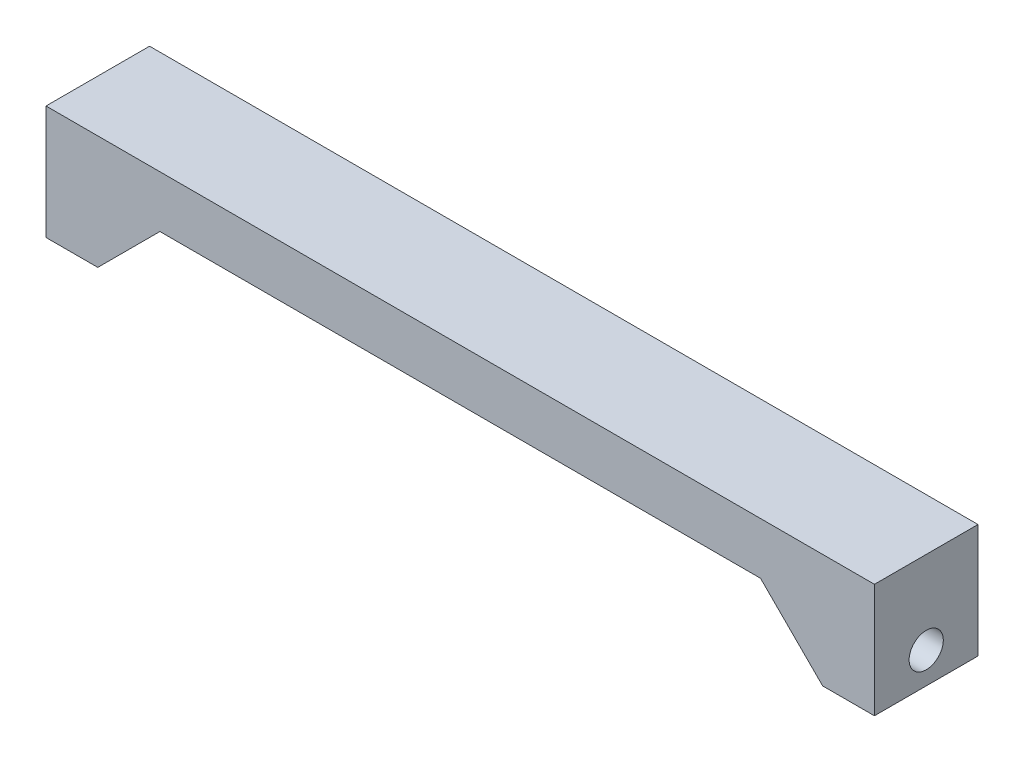
ISO-10303-21;
HEADER;
FILE_DESCRIPTION(('STEP AP214'),'2;1');
FILE_NAME('part.step','',(''),(''),'','','');
FILE_SCHEMA(('AUTOMOTIVE_DESIGN { 1 0 10303 214 1 1 1 1 }'));
ENDSEC;
DATA;
#1=APPLICATION_CONTEXT('core data for automotive mechanical design processes');
#2=APPLICATION_PROTOCOL_DEFINITION('international standard','automotive_design',2000,#1);
#3=PRODUCT_CONTEXT('',#1,'mechanical');
#4=PRODUCT('Part','Part','',(#3));
#5=PRODUCT_RELATED_PRODUCT_CATEGORY('part','',(#4));
#6=PRODUCT_DEFINITION_FORMATION('','',#4);
#7=PRODUCT_DEFINITION_CONTEXT('part definition',#1,'design');
#8=PRODUCT_DEFINITION('design','',#6,#7);
#9=PRODUCT_DEFINITION_SHAPE('','',#8);
#10=(LENGTH_UNIT() NAMED_UNIT(*) SI_UNIT(.MILLI.,.METRE.));
#11=(NAMED_UNIT(*) PLANE_ANGLE_UNIT() SI_UNIT($,.RADIAN.));
#12=(NAMED_UNIT(*) SI_UNIT($,.STERADIAN.) SOLID_ANGLE_UNIT());
#13=UNCERTAINTY_MEASURE_WITH_UNIT(LENGTH_MEASURE(1.E-05),#10,'distance_accuracy_value','');
#14=(GEOMETRIC_REPRESENTATION_CONTEXT(3) GLOBAL_UNCERTAINTY_ASSIGNED_CONTEXT((#13)) GLOBAL_UNIT_ASSIGNED_CONTEXT((#10,
#11,#12)) REPRESENTATION_CONTEXT('',''));
#15=CARTESIAN_POINT('',(0.,0.,0.));
#16=DIRECTION('',(0.,0.,1.));
#17=DIRECTION('',(1.,0.,0.));
#18=AXIS2_PLACEMENT_3D('',#15,#16,#17);
#19=CARTESIAN_POINT('',(35.,-5.00000000000001,10.));
#20=DIRECTION('',(0.,1.,0.));
#21=DIRECTION('',(0.,0.,1.));
#22=AXIS2_PLACEMENT_3D('',#19,#20,#21);
#23=PLANE('',#22);
#24=DIRECTION('',(-1.,0.,0.));
#25=VECTOR('',#24,1.);
#26=CARTESIAN_POINT('',(29.,-5.00000000000001,7.99999999999999));
#27=LINE('',#26,#25);
#28=CARTESIAN_POINT('',(35.,-5.00000000000001,7.99999999999999));
#29=VERTEX_POINT('',#28);
#30=CARTESIAN_POINT('',(29.,-5.00000000000001,7.99999999999999));
#31=VERTEX_POINT('',#30);
#32=EDGE_CURVE('E154',#29,#31,#27,.T.);
#33=ORIENTED_EDGE('',*,*,#32,.T.);
#34=DIRECTION('',(0.,0.,1.));
#35=VECTOR('',#34,1.);
#36=CARTESIAN_POINT('',(29.,-5.00000000000001,7.99999999999999));
#37=LINE('',#36,#35);
#38=CARTESIAN_POINT('',(29.,-5.00000000000001,9.99999999999999));
#39=VERTEX_POINT('',#38);
#40=EDGE_CURVE('E139',#31,#39,#37,.T.);
#41=ORIENTED_EDGE('',*,*,#40,.T.);
#42=DIRECTION('',(1.,0.,0.));
#43=VECTOR('',#42,1.);
#44=CARTESIAN_POINT('',(35.,-5.00000000000001,10.));
#45=LINE('',#44,#43);
#46=CARTESIAN_POINT('',(-29.,-5.00000000000001,9.99999999999999));
#47=VERTEX_POINT('',#46);
#48=EDGE_CURVE('E224',#47,#39,#45,.T.);
#49=ORIENTED_EDGE('',*,*,#48,.F.);
#50=DIRECTION('',(0.,0.,1.));
#51=VECTOR('',#50,1.);
#52=CARTESIAN_POINT('',(-29.,-5.00000000000001,7.99999999999999));
#53=LINE('',#52,#51);
#54=CARTESIAN_POINT('',(-29.,-5.00000000000001,7.99999999999999));
#55=VERTEX_POINT('',#54);
#56=EDGE_CURVE('E184',#55,#47,#53,.T.);
#57=ORIENTED_EDGE('',*,*,#56,.F.);
#58=DIRECTION('',(1.,0.,0.));
#59=VECTOR('',#58,1.);
#60=CARTESIAN_POINT('',(-29.,-5.00000000000001,7.99999999999999));
#61=LINE('',#60,#59);
#62=CARTESIAN_POINT('',(-35.,-5.00000000000001,7.99999999999999));
#63=VERTEX_POINT('',#62);
#64=EDGE_CURVE('E177',#63,#55,#61,.T.);
#65=ORIENTED_EDGE('',*,*,#64,.F.);
#66=DIRECTION('',(0.,0.,-1.));
#67=VECTOR('',#66,1.);
#68=CARTESIAN_POINT('',(-35.,-5.00000000000001,10.));
#69=LINE('',#68,#67);
#70=CARTESIAN_POINT('',(-35.,-5.00000000000001,2.));
#71=VERTEX_POINT('',#70);
#72=EDGE_CURVE('E257',#63,#71,#69,.T.);
#73=ORIENTED_EDGE('',*,*,#72,.T.);
#74=DIRECTION('',(1.,0.,0.));
#75=VECTOR('',#74,1.);
#76=CARTESIAN_POINT('',(-29.,-5.00000000000001,2.));
#77=LINE('',#76,#75);
#78=CARTESIAN_POINT('',(-29.,-5.00000000000001,2.));
#79=VERTEX_POINT('',#78);
#80=EDGE_CURVE('E189',#71,#79,#77,.T.);
#81=ORIENTED_EDGE('',*,*,#80,.T.);
#82=DIRECTION('',(0.,0.,-1.));
#83=VECTOR('',#82,1.);
#84=CARTESIAN_POINT('',(-29.,-5.00000000000001,2.));
#85=LINE('',#84,#83);
#86=CARTESIAN_POINT('',(-29.,-5.00000000000001,0.));
#87=VERTEX_POINT('',#86);
#88=EDGE_CURVE('E197',#79,#87,#85,.T.);
#89=ORIENTED_EDGE('',*,*,#88,.T.);
#90=DIRECTION('',(1.,0.,0.));
#91=VECTOR('',#90,1.);
#92=CARTESIAN_POINT('',(35.,-5.00000000000001,0.));
#93=LINE('',#92,#91);
#94=CARTESIAN_POINT('',(29.,-5.00000000000001,0.));
#95=VERTEX_POINT('',#94);
#96=EDGE_CURVE('E237',#87,#95,#93,.T.);
#97=ORIENTED_EDGE('',*,*,#96,.T.);
#98=DIRECTION('',(0.,0.,-1.));
#99=VECTOR('',#98,1.);
#100=CARTESIAN_POINT('',(29.,-5.00000000000001,2.));
#101=LINE('',#100,#99);
#102=CARTESIAN_POINT('',(29.,-5.00000000000001,2.));
#103=VERTEX_POINT('',#102);
#104=EDGE_CURVE('E52',#103,#95,#101,.T.);
#105=ORIENTED_EDGE('',*,*,#104,.F.);
#106=DIRECTION('',(-1.,0.,0.));
#107=VECTOR('',#106,1.);
#108=CARTESIAN_POINT('',(29.,-5.00000000000001,2.));
#109=LINE('',#108,#107);
#110=CARTESIAN_POINT('',(35.,-5.00000000000001,2.));
#111=VERTEX_POINT('',#110);
#112=EDGE_CURVE('E161',#111,#103,#109,.T.);
#113=ORIENTED_EDGE('',*,*,#112,.F.);
#114=DIRECTION('',(0.,0.,-1.));
#115=VECTOR('',#114,1.);
#116=CARTESIAN_POINT('',(35.,-5.00000000000001,10.));
#117=LINE('',#116,#115);
#118=EDGE_CURVE('E60',#29,#111,#117,.T.);
#119=ORIENTED_EDGE('',*,*,#118,.F.);
#120=EDGE_LOOP('',(#33,#41,#49,#57,#65,#73,#81,#89,#97,#105,#113,#119));
#121=FACE_BOUND('',#120,.T.);
#122=ADVANCED_FACE('F37',(#121),#23,.F.);
#123=CARTESIAN_POINT('',(-40.,-11.,10.));
#124=DIRECTION('',(1.,0.,0.));
#125=DIRECTION('',(0.,0.,-1.));
#126=AXIS2_PLACEMENT_3D('',#123,#124,#125);
#127=PLANE('',#126);
#128=CARTESIAN_POINT('',(-40.,-7.99999999999999,5.));
#129=DIRECTION('',(1.,0.,0.));
#130=DIRECTION('',(0.,1.,0.));
#131=AXIS2_PLACEMENT_3D('',#128,#129,#130);
#132=CIRCLE('',#131,1.65);
#133=CARTESIAN_POINT('',(-40.,-6.34999999999999,5.));
#134=VERTEX_POINT('',#133);
#135=EDGE_CURVE('E207',#134,#134,#132,.T.);
#136=ORIENTED_EDGE('',*,*,#135,.T.);
#137=EDGE_LOOP('',(#136));
#138=FACE_BOUND('',#137,.T.);
#139=DIRECTION('',(0.,-1.,0.));
#140=VECTOR('',#139,1.);
#141=CARTESIAN_POINT('',(-40.,-11.,0.));
#142=LINE('',#141,#140);
#143=CARTESIAN_POINT('',(-40.,0.,0.));
#144=VERTEX_POINT('',#143);
#145=CARTESIAN_POINT('',(-40.,-11.,0.));
#146=VERTEX_POINT('',#145);
#147=EDGE_CURVE('E216',#144,#146,#142,.T.);
#148=ORIENTED_EDGE('',*,*,#147,.T.);
#149=DIRECTION('',(0.,0.,-1.));
#150=VECTOR('',#149,1.);
#151=CARTESIAN_POINT('',(-40.,-11.,10.));
#152=LINE('',#151,#150);
#153=CARTESIAN_POINT('',(-40.,-11.,10.));
#154=VERTEX_POINT('',#153);
#155=EDGE_CURVE('E11',#154,#146,#152,.T.);
#156=ORIENTED_EDGE('',*,*,#155,.F.);
#157=DIRECTION('',(0.,-1.,0.));
#158=VECTOR('',#157,1.);
#159=CARTESIAN_POINT('',(-40.,-11.,10.));
#160=LINE('',#159,#158);
#161=CARTESIAN_POINT('',(-40.,0.,10.));
#162=VERTEX_POINT('',#161);
#163=EDGE_CURVE('E217',#162,#154,#160,.T.);
#164=ORIENTED_EDGE('',*,*,#163,.F.);
#165=DIRECTION('',(0.,0.,-1.));
#166=VECTOR('',#165,1.);
#167=CARTESIAN_POINT('',(-40.,0.,10.));
#168=LINE('',#167,#166);
#169=EDGE_CURVE('E232',#162,#144,#168,.T.);
#170=ORIENTED_EDGE('',*,*,#169,.T.);
#171=EDGE_LOOP('',(#148,#156,#164,#170));
#172=FACE_BOUND('',#171,.T.);
#173=ADVANCED_FACE('F39',(#138,#172),#127,.F.);
#174=CARTESIAN_POINT('',(-35.,-11.,10.));
#175=DIRECTION('',(0.,1.,0.));
#176=DIRECTION('',(-1.,0.,0.));
#177=AXIS2_PLACEMENT_3D('',#174,#175,#176);
#178=PLANE('',#177);
#179=DIRECTION('',(1.,0.,0.));
#180=VECTOR('',#179,1.);
#181=CARTESIAN_POINT('',(-35.,-11.,0.));
#182=LINE('',#181,#180);
#183=CARTESIAN_POINT('',(-35.,-11.,0.));
#184=VERTEX_POINT('',#183);
#185=EDGE_CURVE('E235',#146,#184,#182,.T.);
#186=ORIENTED_EDGE('',*,*,#185,.T.);
#187=DIRECTION('',(0.,0.,-1.));
#188=VECTOR('',#187,1.);
#189=CARTESIAN_POINT('',(-35.,-11.,2.));
#190=LINE('',#189,#188);
#191=CARTESIAN_POINT('',(-35.,-11.,2.));
#192=VERTEX_POINT('',#191);
#193=EDGE_CURVE('E200',#192,#184,#190,.T.);
#194=ORIENTED_EDGE('',*,*,#193,.F.);
#195=DIRECTION('',(0.,0.,-1.));
#196=VECTOR('',#195,1.);
#197=CARTESIAN_POINT('',(-35.,-11.,10.));
#198=LINE('',#197,#196);
#199=CARTESIAN_POINT('',(-35.,-11.,7.99999999999999));
#200=VERTEX_POINT('',#199);
#201=EDGE_CURVE('E258',#200,#192,#198,.T.);
#202=ORIENTED_EDGE('',*,*,#201,.F.);
#203=CARTESIAN_POINT('',(-35.,-11.,9.99999999999999));
#204=VERTEX_POINT('',#203);
#205=EDGE_CURVE('E45',#204,#200,#198,.T.);
#206=ORIENTED_EDGE('',*,*,#205,.F.);
#207=DIRECTION('',(1.,0.,0.));
#208=VECTOR('',#207,1.);
#209=CARTESIAN_POINT('',(-35.,-11.,10.));
#210=LINE('',#209,#208);
#211=EDGE_CURVE('E220',#154,#204,#210,.T.);
#212=ORIENTED_EDGE('',*,*,#211,.F.);
#213=ORIENTED_EDGE('',*,*,#155,.T.);
#214=EDGE_LOOP('',(#186,#194,#202,#206,#212,#213));
#215=FACE_BOUND('',#214,.T.);
#216=ADVANCED_FACE('F271',(#215),#178,.F.);
#217=CARTESIAN_POINT('',(-35.,-5.00000000000001,10.));
#218=DIRECTION('',(-1.,0.,0.));
#219=DIRECTION('',(0.,0.,1.));
#220=AXIS2_PLACEMENT_3D('',#217,#218,#219);
#221=PLANE('',#220);
#222=CARTESIAN_POINT('',(-35.,-8.,5.));
#223=DIRECTION('',(-1.,0.,0.));
#224=DIRECTION('',(0.,0.,1.));
#225=AXIS2_PLACEMENT_3D('',#222,#223,#224);
#226=CIRCLE('',#225,1.65);
#227=CARTESIAN_POINT('',(-35.,-8.,6.65));
#228=VERTEX_POINT('',#227);
#229=EDGE_CURVE('E213',#228,#228,#226,.T.);
#230=ORIENTED_EDGE('',*,*,#229,.T.);
#231=EDGE_LOOP('',(#230));
#232=FACE_BOUND('',#231,.T.);
#233=ORIENTED_EDGE('',*,*,#72,.F.);
#234=DIRECTION('',(0.,1.,0.));
#235=VECTOR('',#234,1.);
#236=CARTESIAN_POINT('',(-35.,-5.00000000000001,7.99999999999999));
#237=LINE('',#236,#235);
#238=EDGE_CURVE('E180',#200,#63,#237,.T.);
#239=ORIENTED_EDGE('',*,*,#238,.F.);
#240=ORIENTED_EDGE('',*,*,#201,.T.);
#241=DIRECTION('',(0.,1.,0.));
#242=VECTOR('',#241,1.);
#243=CARTESIAN_POINT('',(-35.,-5.00000000000001,2.));
#244=LINE('',#243,#242);
#245=EDGE_CURVE('E194',#192,#71,#244,.T.);
#246=ORIENTED_EDGE('',*,*,#245,.T.);
#247=EDGE_LOOP('',(#233,#239,#240,#246));
#248=FACE_BOUND('',#247,.T.);
#249=ADVANCED_FACE('F267',(#232,#248),#221,.F.);
#250=CARTESIAN_POINT('',(35.,-11.,10.));
#251=DIRECTION('',(1.,0.,0.));
#252=DIRECTION('',(0.,0.,-1.));
#253=AXIS2_PLACEMENT_3D('',#250,#251,#252);
#254=PLANE('',#253);
#255=CARTESIAN_POINT('',(35.,-8.00000000000004,5.));
#256=DIRECTION('',(1.,0.,0.));
#257=DIRECTION('',(0.,0.,-1.));
#258=AXIS2_PLACEMENT_3D('',#255,#256,#257);
#259=CIRCLE('',#258,1.65);
#260=CARTESIAN_POINT('',(35.,-8.00000000000004,3.35));
#261=VERTEX_POINT('',#260);
#262=EDGE_CURVE('E210',#261,#261,#259,.T.);
#263=ORIENTED_EDGE('',*,*,#262,.T.);
#264=EDGE_LOOP('',(#263));
#265=FACE_BOUND('',#264,.T.);
#266=DIRECTION('',(0.,0.,-1.));
#267=VECTOR('',#266,1.);
#268=CARTESIAN_POINT('',(35.,-11.,10.));
#269=LINE('',#268,#267);
#270=CARTESIAN_POINT('',(35.,-11.,7.99999999999999));
#271=VERTEX_POINT('',#270);
#272=CARTESIAN_POINT('',(35.,-11.,2.));
#273=VERTEX_POINT('',#272);
#274=EDGE_CURVE('E252',#271,#273,#269,.T.);
#275=ORIENTED_EDGE('',*,*,#274,.F.);
#276=DIRECTION('',(0.,1.,0.));
#277=VECTOR('',#276,1.);
#278=CARTESIAN_POINT('',(35.,-5.00000000000001,7.99999999999999));
#279=LINE('',#278,#277);
#280=EDGE_CURVE('E150',#271,#29,#279,.T.);
#281=ORIENTED_EDGE('',*,*,#280,.T.);
#282=ORIENTED_EDGE('',*,*,#118,.T.);
#283=DIRECTION('',(0.,1.,0.));
#284=VECTOR('',#283,1.);
#285=CARTESIAN_POINT('',(35.,-5.00000000000001,2.));
#286=LINE('',#285,#284);
#287=EDGE_CURVE('E164',#273,#111,#286,.T.);
#288=ORIENTED_EDGE('',*,*,#287,.F.);
#289=EDGE_LOOP('',(#275,#281,#282,#288));
#290=FACE_BOUND('',#289,.T.);
#291=ADVANCED_FACE('F302',(#265,#290),#254,.F.);
#292=CARTESIAN_POINT('',(40.,-11.,10.));
#293=DIRECTION('',(0.,1.,0.));
#294=DIRECTION('',(-1.,0.,0.));
#295=AXIS2_PLACEMENT_3D('',#292,#293,#294);
#296=PLANE('',#295);
#297=DIRECTION('',(1.,0.,0.));
#298=VECTOR('',#297,1.);
#299=CARTESIAN_POINT('',(40.,-11.,0.));
#300=LINE('',#299,#298);
#301=CARTESIAN_POINT('',(35.,-11.,0.));
#302=VERTEX_POINT('',#301);
#303=CARTESIAN_POINT('',(40.,-11.,0.));
#304=VERTEX_POINT('',#303);
#305=EDGE_CURVE('E239',#302,#304,#300,.T.);
#306=ORIENTED_EDGE('',*,*,#305,.T.);
#307=DIRECTION('',(0.,0.,-1.));
#308=VECTOR('',#307,1.);
#309=CARTESIAN_POINT('',(40.,-11.,10.));
#310=LINE('',#309,#308);
#311=CARTESIAN_POINT('',(40.,-11.,10.));
#312=VERTEX_POINT('',#311);
#313=EDGE_CURVE('E249',#312,#304,#310,.T.);
#314=ORIENTED_EDGE('',*,*,#313,.F.);
#315=DIRECTION('',(1.,0.,0.));
#316=VECTOR('',#315,1.);
#317=CARTESIAN_POINT('',(40.,-11.,10.));
#318=LINE('',#317,#316);
#319=CARTESIAN_POINT('',(35.,-11.,10.));
#320=VERTEX_POINT('',#319);
#321=EDGE_CURVE('E226',#320,#312,#318,.T.);
#322=ORIENTED_EDGE('',*,*,#321,.F.);
#323=EDGE_CURVE('E253',#320,#271,#269,.T.);
#324=ORIENTED_EDGE('',*,*,#323,.T.);
#325=ORIENTED_EDGE('',*,*,#274,.T.);
#326=DIRECTION('',(0.,0.,-1.));
#327=VECTOR('',#326,1.);
#328=CARTESIAN_POINT('',(35.,-11.,2.));
#329=LINE('',#328,#327);
#330=EDGE_CURVE('E170',#273,#302,#329,.T.);
#331=ORIENTED_EDGE('',*,*,#330,.T.);
#332=EDGE_LOOP('',(#306,#314,#322,#324,#325,#331));
#333=FACE_BOUND('',#332,.T.);
#334=ADVANCED_FACE('F305',(#333),#296,.F.);
#335=CARTESIAN_POINT('',(40.,0.,10.));
#336=DIRECTION('',(-1.,0.,0.));
#337=DIRECTION('',(0.,0.,1.));
#338=AXIS2_PLACEMENT_3D('',#335,#336,#337);
#339=PLANE('',#338);
#340=CARTESIAN_POINT('',(40.,-8.00000000000004,5.));
#341=DIRECTION('',(1.,0.,0.));
#342=DIRECTION('',(0.,1.,0.));
#343=AXIS2_PLACEMENT_3D('',#340,#341,#342);
#344=CIRCLE('',#343,1.65);
#345=CARTESIAN_POINT('',(40.,-6.35000000000004,5.));
#346=VERTEX_POINT('',#345);
#347=EDGE_CURVE('E203',#346,#346,#344,.T.);
#348=ORIENTED_EDGE('',*,*,#347,.F.);
#349=EDGE_LOOP('',(#348));
#350=FACE_BOUND('',#349,.T.);
#351=DIRECTION('',(0.,1.,0.));
#352=VECTOR('',#351,1.);
#353=CARTESIAN_POINT('',(40.,0.,0.));
#354=LINE('',#353,#352);
#355=CARTESIAN_POINT('',(40.,0.,0.));
#356=VERTEX_POINT('',#355);
#357=EDGE_CURVE('E241',#304,#356,#354,.T.);
#358=ORIENTED_EDGE('',*,*,#357,.T.);
#359=DIRECTION('',(0.,0.,-1.));
#360=VECTOR('',#359,1.);
#361=CARTESIAN_POINT('',(40.,0.,10.));
#362=LINE('',#361,#360);
#363=CARTESIAN_POINT('',(40.,0.,10.));
#364=VERTEX_POINT('',#363);
#365=EDGE_CURVE('E246',#364,#356,#362,.T.);
#366=ORIENTED_EDGE('',*,*,#365,.F.);
#367=DIRECTION('',(0.,1.,0.));
#368=VECTOR('',#367,1.);
#369=CARTESIAN_POINT('',(40.,0.,10.));
#370=LINE('',#369,#368);
#371=EDGE_CURVE('E228',#312,#364,#370,.T.);
#372=ORIENTED_EDGE('',*,*,#371,.F.);
#373=ORIENTED_EDGE('',*,*,#313,.T.);
#374=EDGE_LOOP('',(#358,#366,#372,#373));
#375=FACE_BOUND('',#374,.T.);
#376=ADVANCED_FACE('F311',(#350,#375),#339,.F.);
#377=CARTESIAN_POINT('',(-40.,0.,10.));
#378=DIRECTION('',(0.,-1.,0.));
#379=DIRECTION('',(0.,0.,-1.));
#380=AXIS2_PLACEMENT_3D('',#377,#378,#379);
#381=PLANE('',#380);
#382=DIRECTION('',(-1.,0.,0.));
#383=VECTOR('',#382,1.);
#384=CARTESIAN_POINT('',(-40.,0.,0.));
#385=LINE('',#384,#383);
#386=EDGE_CURVE('E221',#356,#144,#385,.T.);
#387=ORIENTED_EDGE('',*,*,#386,.T.);
#388=ORIENTED_EDGE('',*,*,#169,.F.);
#389=DIRECTION('',(-1.,0.,0.));
#390=VECTOR('',#389,1.);
#391=CARTESIAN_POINT('',(-40.,0.,10.));
#392=LINE('',#391,#390);
#393=EDGE_CURVE('E230',#364,#162,#392,.T.);
#394=ORIENTED_EDGE('',*,*,#393,.F.);
#395=ORIENTED_EDGE('',*,*,#365,.T.);
#396=EDGE_LOOP('',(#387,#388,#394,#395));
#397=FACE_BOUND('',#396,.T.);
#398=ADVANCED_FACE('F313',(#397),#381,.F.);
#399=CARTESIAN_POINT('',(0.,0.,10.));
#400=DIRECTION('',(0.,0.,-1.));
#401=DIRECTION('',(-1.,0.,0.));
#402=AXIS2_PLACEMENT_3D('',#399,#400,#401);
#403=PLANE('',#402);
#404=ORIENTED_EDGE('',*,*,#48,.T.);
#405=DIRECTION('',(0.707106781186548,-0.707106781186547,0.));
#406=VECTOR('',#405,1.);
#407=CARTESIAN_POINT('',(29.,-5.00000000000001,9.99999999999999));
#408=LINE('',#407,#406);
#409=EDGE_CURVE('E145',#39,#320,#408,.T.);
#410=ORIENTED_EDGE('',*,*,#409,.T.);
#411=ORIENTED_EDGE('',*,*,#321,.T.);
#412=ORIENTED_EDGE('',*,*,#371,.T.);
#413=ORIENTED_EDGE('',*,*,#393,.T.);
#414=ORIENTED_EDGE('',*,*,#163,.T.);
#415=ORIENTED_EDGE('',*,*,#211,.T.);
#416=DIRECTION('',(-0.707106781186548,-0.707106781186547,0.));
#417=VECTOR('',#416,1.);
#418=CARTESIAN_POINT('',(-29.,-5.00000000000001,9.99999999999999));
#419=LINE('',#418,#417);
#420=EDGE_CURVE('E174',#47,#204,#419,.T.);
#421=ORIENTED_EDGE('',*,*,#420,.F.);
#422=EDGE_LOOP('',(#404,#410,#411,#412,#413,#414,#415,#421));
#423=FACE_BOUND('',#422,.T.);
#424=ADVANCED_FACE('F286',(#423),#403,.F.);
#425=CARTESIAN_POINT('',(0.,0.,0.));
#426=DIRECTION('',(0.,0.,-1.));
#427=DIRECTION('',(-1.,0.,0.));
#428=AXIS2_PLACEMENT_3D('',#425,#426,#427);
#429=PLANE('',#428);
#430=DIRECTION('',(0.707106781186548,-0.707106781186547,0.));
#431=VECTOR('',#430,1.);
#432=CARTESIAN_POINT('',(29.,-5.00000000000001,0.));
#433=LINE('',#432,#431);
#434=EDGE_CURVE('E149',#95,#302,#433,.T.);
#435=ORIENTED_EDGE('',*,*,#434,.F.);
#436=ORIENTED_EDGE('',*,*,#96,.F.);
#437=DIRECTION('',(-0.707106781186548,-0.707106781186547,0.));
#438=VECTOR('',#437,1.);
#439=CARTESIAN_POINT('',(-29.,-5.00000000000001,0.));
#440=LINE('',#439,#438);
#441=EDGE_CURVE('E188',#87,#184,#440,.T.);
#442=ORIENTED_EDGE('',*,*,#441,.T.);
#443=ORIENTED_EDGE('',*,*,#185,.F.);
#444=ORIENTED_EDGE('',*,*,#147,.F.);
#445=ORIENTED_EDGE('',*,*,#386,.F.);
#446=ORIENTED_EDGE('',*,*,#357,.F.);
#447=ORIENTED_EDGE('',*,*,#305,.F.);
#448=EDGE_LOOP('',(#435,#436,#442,#443,#444,#445,#446,#447));
#449=FACE_BOUND('',#448,.T.);
#450=ADVANCED_FACE('F295',(#449),#429,.T.);
#451=CARTESIAN_POINT('',(-40.,-7.99999999999999,5.));
#452=DIRECTION('',(1.,0.,0.));
#453=DIRECTION('',(0.,1.,0.));
#454=AXIS2_PLACEMENT_3D('',#451,#452,#453);
#455=CYLINDRICAL_SURFACE('',#454,1.65);
#456=ORIENTED_EDGE('',*,*,#347,.T.);
#457=EDGE_LOOP('',(#456));
#458=FACE_BOUND('',#457,.T.);
#459=ORIENTED_EDGE('',*,*,#262,.F.);
#460=EDGE_LOOP('',(#459));
#461=FACE_BOUND('',#460,.T.);
#462=ADVANCED_FACE('F370',(#458,#461),#455,.F.);
#463=ORIENTED_EDGE('',*,*,#135,.F.);
#464=EDGE_LOOP('',(#463));
#465=FACE_BOUND('',#464,.T.);
#466=ORIENTED_EDGE('',*,*,#229,.F.);
#467=EDGE_LOOP('',(#466));
#468=FACE_BOUND('',#467,.T.);
#469=ADVANCED_FACE('F375',(#465,#468),#455,.F.);
#470=CARTESIAN_POINT('',(-29.,-5.00000000000001,2.));
#471=DIRECTION('',(0.707106781186547,-0.707106781186548,0.));
#472=DIRECTION('',(0.707106781186548,0.707106781186547,0.));
#473=AXIS2_PLACEMENT_3D('',#470,#471,#472);
#474=PLANE('',#473);
#475=ORIENTED_EDGE('',*,*,#441,.F.);
#476=ORIENTED_EDGE('',*,*,#88,.F.);
#477=DIRECTION('',(-0.707106781186548,-0.707106781186547,0.));
#478=VECTOR('',#477,1.);
#479=CARTESIAN_POINT('',(-29.,-5.00000000000001,2.));
#480=LINE('',#479,#478);
#481=EDGE_CURVE('E191',#79,#192,#480,.T.);
#482=ORIENTED_EDGE('',*,*,#481,.T.);
#483=ORIENTED_EDGE('',*,*,#193,.T.);
#484=EDGE_LOOP('',(#475,#476,#482,#483));
#485=FACE_BOUND('',#484,.T.);
#486=ADVANCED_FACE('F276',(#485),#474,.T.);
#487=CARTESIAN_POINT('',(0.,0.,2.));
#488=DIRECTION('',(0.,0.,1.));
#489=DIRECTION('',(1.,0.,0.));
#490=AXIS2_PLACEMENT_3D('',#487,#488,#489);
#491=PLANE('',#490);
#492=ORIENTED_EDGE('',*,*,#80,.F.);
#493=ORIENTED_EDGE('',*,*,#245,.F.);
#494=ORIENTED_EDGE('',*,*,#481,.F.);
#495=EDGE_LOOP('',(#492,#493,#494));
#496=FACE_BOUND('',#495,.T.);
#497=ADVANCED_FACE('F278',(#496),#491,.T.);
#498=CARTESIAN_POINT('',(-29.,-5.00000000000001,7.99999999999999));
#499=DIRECTION('',(-0.707106781186547,0.707106781186548,0.));
#500=DIRECTION('',(-0.707106781186548,-0.707106781186547,0.));
#501=AXIS2_PLACEMENT_3D('',#498,#499,#500);
#502=PLANE('',#501);
#503=ORIENTED_EDGE('',*,*,#420,.T.);
#504=ORIENTED_EDGE('',*,*,#205,.T.);
#505=DIRECTION('',(-0.707106781186548,-0.707106781186547,0.));
#506=VECTOR('',#505,1.);
#507=CARTESIAN_POINT('',(-29.,-5.00000000000001,7.99999999999999));
#508=LINE('',#507,#506);
#509=EDGE_CURVE('E182',#55,#200,#508,.T.);
#510=ORIENTED_EDGE('',*,*,#509,.F.);
#511=ORIENTED_EDGE('',*,*,#56,.T.);
#512=EDGE_LOOP('',(#503,#504,#510,#511));
#513=FACE_BOUND('',#512,.T.);
#514=ADVANCED_FACE('F284',(#513),#502,.F.);
#515=CARTESIAN_POINT('',(0.,0.,7.99999999999999));
#516=DIRECTION('',(0.,0.,-1.));
#517=DIRECTION('',(1.,0.,0.));
#518=AXIS2_PLACEMENT_3D('',#515,#516,#517);
#519=PLANE('',#518);
#520=ORIENTED_EDGE('',*,*,#64,.T.);
#521=ORIENTED_EDGE('',*,*,#509,.T.);
#522=ORIENTED_EDGE('',*,*,#238,.T.);
#523=EDGE_LOOP('',(#520,#521,#522));
#524=FACE_BOUND('',#523,.T.);
#525=ADVANCED_FACE('F283',(#524),#519,.T.);
#526=CARTESIAN_POINT('',(29.,-5.00000000000001,2.));
#527=DIRECTION('',(0.707106781186547,0.707106781186548,0.));
#528=DIRECTION('',(-0.707106781186548,0.707106781186547,0.));
#529=AXIS2_PLACEMENT_3D('',#526,#527,#528);
#530=PLANE('',#529);
#531=ORIENTED_EDGE('',*,*,#434,.T.);
#532=ORIENTED_EDGE('',*,*,#330,.F.);
#533=DIRECTION('',(0.707106781186548,-0.707106781186547,0.));
#534=VECTOR('',#533,1.);
#535=CARTESIAN_POINT('',(29.,-5.00000000000001,2.));
#536=LINE('',#535,#534);
#537=EDGE_CURVE('E167',#103,#273,#536,.T.);
#538=ORIENTED_EDGE('',*,*,#537,.F.);
#539=ORIENTED_EDGE('',*,*,#104,.T.);
#540=EDGE_LOOP('',(#531,#532,#538,#539));
#541=FACE_BOUND('',#540,.T.);
#542=ADVANCED_FACE('F299',(#541),#530,.F.);
#543=CARTESIAN_POINT('',(0.,0.,2.));
#544=DIRECTION('',(0.,0.,1.));
#545=DIRECTION('',(-1.,0.,0.));
#546=AXIS2_PLACEMENT_3D('',#543,#544,#545);
#547=PLANE('',#546);
#548=ORIENTED_EDGE('',*,*,#112,.T.);
#549=ORIENTED_EDGE('',*,*,#537,.T.);
#550=ORIENTED_EDGE('',*,*,#287,.T.);
#551=EDGE_LOOP('',(#548,#549,#550));
#552=FACE_BOUND('',#551,.T.);
#553=ADVANCED_FACE('F301',(#552),#547,.T.);
#554=CARTESIAN_POINT('',(29.,-5.00000000000001,7.99999999999999));
#555=DIRECTION('',(-0.707106781186547,-0.707106781186548,0.));
#556=DIRECTION('',(0.707106781186548,-0.707106781186547,0.));
#557=AXIS2_PLACEMENT_3D('',#554,#555,#556);
#558=PLANE('',#557);
#559=ORIENTED_EDGE('',*,*,#409,.F.);
#560=ORIENTED_EDGE('',*,*,#40,.F.);
#561=DIRECTION('',(0.707106781186548,-0.707106781186547,0.));
#562=VECTOR('',#561,1.);
#563=CARTESIAN_POINT('',(29.,-5.00000000000001,7.99999999999999));
#564=LINE('',#563,#562);
#565=EDGE_CURVE('E143',#31,#271,#564,.T.);
#566=ORIENTED_EDGE('',*,*,#565,.T.);
#567=ORIENTED_EDGE('',*,*,#323,.F.);
#568=EDGE_LOOP('',(#559,#560,#566,#567));
#569=FACE_BOUND('',#568,.T.);
#570=ADVANCED_FACE('F141',(#569),#558,.T.);
#571=CARTESIAN_POINT('',(0.,0.,7.99999999999999));
#572=DIRECTION('',(0.,0.,-1.));
#573=DIRECTION('',(-1.,0.,0.));
#574=AXIS2_PLACEMENT_3D('',#571,#572,#573);
#575=PLANE('',#574);
#576=ORIENTED_EDGE('',*,*,#32,.F.);
#577=ORIENTED_EDGE('',*,*,#280,.F.);
#578=ORIENTED_EDGE('',*,*,#565,.F.);
#579=EDGE_LOOP('',(#576,#577,#578));
#580=FACE_BOUND('',#579,.T.);
#581=ADVANCED_FACE('F153',(#580),#575,.T.);
#582=CLOSED_SHELL('',(#122,#173,#216,#249,#291,#334,#376,#398,#424,#450,#462,#469,#486,#497,
#514,#525,#542,#553,#570,#581));
#583=MANIFOLD_SOLID_BREP('B2',#582);
#584=ADVANCED_BREP_SHAPE_REPRESENTATION('',(#18,#583),#14);
#585=SHAPE_DEFINITION_REPRESENTATION(#9,#584);
ENDSEC;
END-ISO-10303-21;
